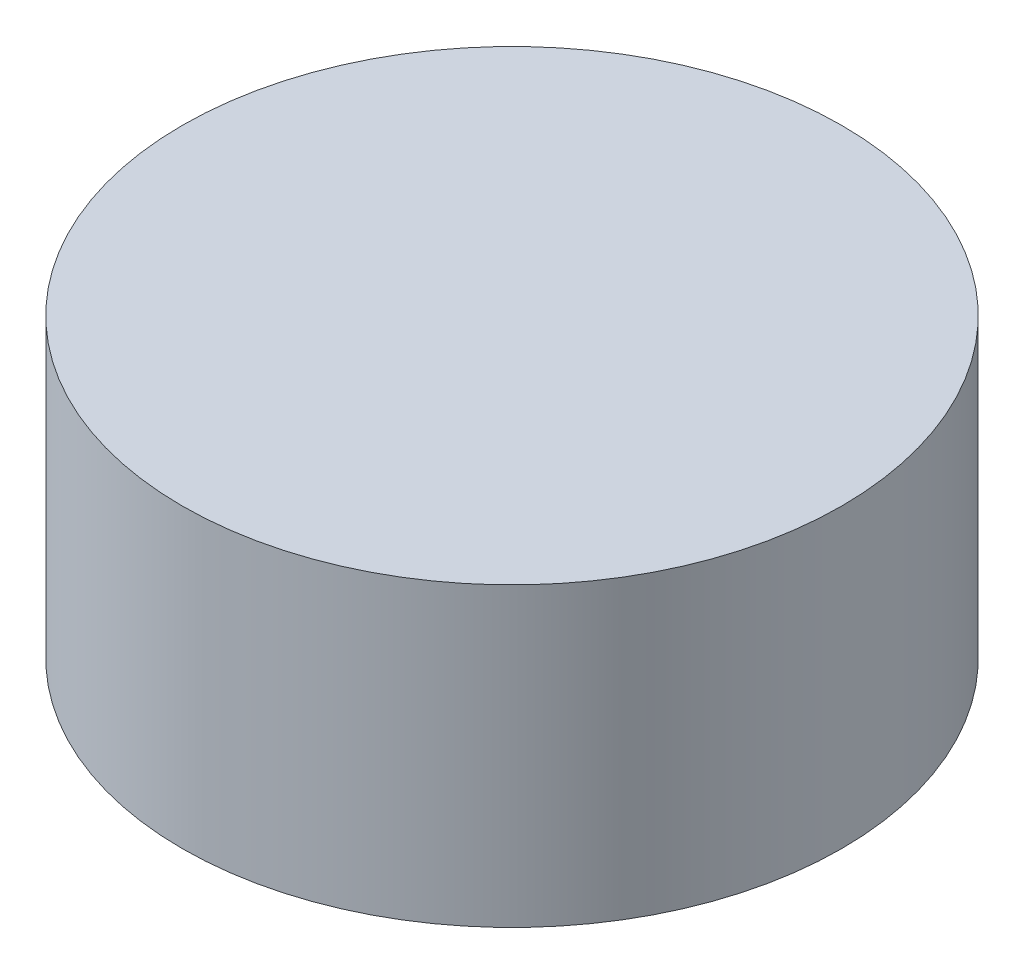
ISO-10303-21;
HEADER;
FILE_DESCRIPTION(('STEP AP214'),'2;1');
FILE_NAME('part.step','',(''),(''),'','','');
FILE_SCHEMA(('AUTOMOTIVE_DESIGN { 1 0 10303 214 1 1 1 1 }'));
ENDSEC;
DATA;
#1=APPLICATION_CONTEXT('core data for automotive mechanical design processes');
#2=APPLICATION_PROTOCOL_DEFINITION('international standard','automotive_design',2000,#1);
#3=PRODUCT_CONTEXT('',#1,'mechanical');
#4=PRODUCT('Part','Part','',(#3));
#5=PRODUCT_RELATED_PRODUCT_CATEGORY('part','',(#4));
#6=PRODUCT_DEFINITION_FORMATION('','',#4);
#7=PRODUCT_DEFINITION_CONTEXT('part definition',#1,'design');
#8=PRODUCT_DEFINITION('design','',#6,#7);
#9=PRODUCT_DEFINITION_SHAPE('','',#8);
#10=(LENGTH_UNIT() NAMED_UNIT(*) SI_UNIT(.MILLI.,.METRE.));
#11=(NAMED_UNIT(*) PLANE_ANGLE_UNIT() SI_UNIT($,.RADIAN.));
#12=(NAMED_UNIT(*) SI_UNIT($,.STERADIAN.) SOLID_ANGLE_UNIT());
#13=UNCERTAINTY_MEASURE_WITH_UNIT(LENGTH_MEASURE(1.E-05),#10,'distance_accuracy_value','');
#14=(GEOMETRIC_REPRESENTATION_CONTEXT(3) GLOBAL_UNCERTAINTY_ASSIGNED_CONTEXT((#13)) GLOBAL_UNIT_ASSIGNED_CONTEXT((#10,
#11,#12)) REPRESENTATION_CONTEXT('',''));
#15=CARTESIAN_POINT('',(0.,0.,0.));
#16=DIRECTION('',(0.,0.,1.));
#17=DIRECTION('',(1.,0.,0.));
#18=AXIS2_PLACEMENT_3D('',#15,#16,#17);
#19=CARTESIAN_POINT('',(0.,4.5,0.));
#20=DIRECTION('',(0.,-1.,0.));
#21=DIRECTION('',(0.,0.,-1.));
#22=AXIS2_PLACEMENT_3D('',#19,#20,#21);
#23=CYLINDRICAL_SURFACE('',#22,5.);
#24=CARTESIAN_POINT('',(0.,4.5,0.));
#25=DIRECTION('',(0.,1.,0.));
#26=DIRECTION('',(0.,0.,1.));
#27=AXIS2_PLACEMENT_3D('',#24,#25,#26);
#28=CIRCLE('',#27,5.);
#29=CARTESIAN_POINT('',(0.,4.5,5.));
#30=VERTEX_POINT('',#29);
#31=EDGE_CURVE('E10',#30,#30,#28,.T.);
#32=ORIENTED_EDGE('',*,*,#31,.F.);
#33=EDGE_LOOP('',(#32));
#34=FACE_BOUND('',#33,.T.);
#35=CARTESIAN_POINT('',(0.,0.,0.));
#36=DIRECTION('',(0.,1.,0.));
#37=DIRECTION('',(0.,0.,1.));
#38=AXIS2_PLACEMENT_3D('',#35,#36,#37);
#39=CIRCLE('',#38,5.);
#40=CARTESIAN_POINT('',(0.,0.,5.));
#41=VERTEX_POINT('',#40);
#42=EDGE_CURVE('E34',#41,#41,#39,.T.);
#43=ORIENTED_EDGE('',*,*,#42,.T.);
#44=EDGE_LOOP('',(#43));
#45=FACE_BOUND('',#44,.T.);
#46=ADVANCED_FACE('F31',(#34,#45),#23,.T.);
#47=CARTESIAN_POINT('',(0.,4.5,0.));
#48=DIRECTION('',(0.,1.,0.));
#49=DIRECTION('',(0.,0.,1.));
#50=AXIS2_PLACEMENT_3D('',#47,#48,#49);
#51=PLANE('',#50);
#52=ORIENTED_EDGE('',*,*,#31,.T.);
#53=EDGE_LOOP('',(#52));
#54=FACE_BOUND('',#53,.T.);
#55=ADVANCED_FACE('F46',(#54),#51,.T.);
#56=CARTESIAN_POINT('',(0.,0.,0.));
#57=DIRECTION('',(0.,1.,0.));
#58=DIRECTION('',(0.,0.,1.));
#59=AXIS2_PLACEMENT_3D('',#56,#57,#58);
#60=PLANE('',#59);
#61=ORIENTED_EDGE('',*,*,#42,.F.);
#62=EDGE_LOOP('',(#61));
#63=FACE_BOUND('',#62,.T.);
#64=ADVANCED_FACE('F44',(#63),#60,.F.);
#65=CLOSED_SHELL('',(#46,#55,#64));
#66=MANIFOLD_SOLID_BREP('B2',#65);
#67=ADVANCED_BREP_SHAPE_REPRESENTATION('',(#18,#66),#14);
#68=SHAPE_DEFINITION_REPRESENTATION(#9,#67);
ENDSEC;
END-ISO-10303-21;
